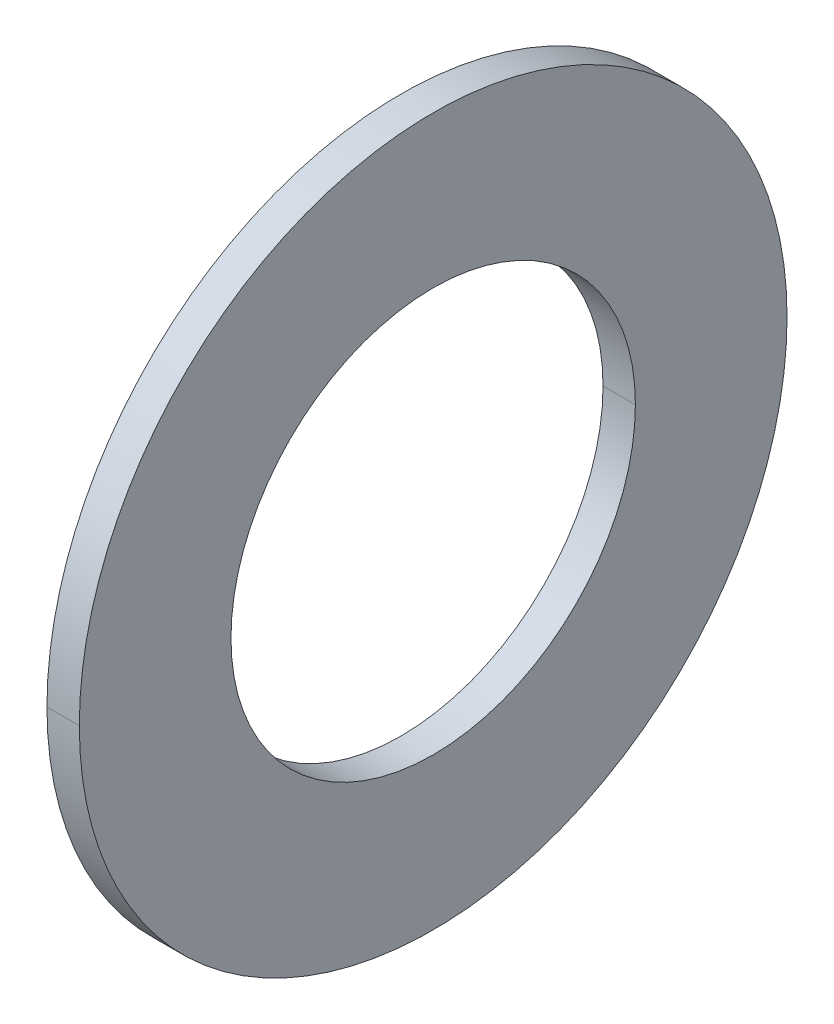
ISO-10303-21;
HEADER;
FILE_DESCRIPTION(('STEP AP214'),'2;1');
FILE_NAME('part.step','',(''),(''),'','','');
FILE_SCHEMA(('AUTOMOTIVE_DESIGN { 1 0 10303 214 1 1 1 1 }'));
ENDSEC;
DATA;
#1=APPLICATION_CONTEXT('core data for automotive mechanical design processes');
#2=APPLICATION_PROTOCOL_DEFINITION('international standard','automotive_design',2000,#1);
#3=PRODUCT_CONTEXT('',#1,'mechanical');
#4=PRODUCT('Part','Part','',(#3));
#5=PRODUCT_RELATED_PRODUCT_CATEGORY('part','',(#4));
#6=PRODUCT_DEFINITION_FORMATION('','',#4);
#7=PRODUCT_DEFINITION_CONTEXT('part definition',#1,'design');
#8=PRODUCT_DEFINITION('design','',#6,#7);
#9=PRODUCT_DEFINITION_SHAPE('','',#8);
#10=(LENGTH_UNIT() NAMED_UNIT(*) SI_UNIT(.MILLI.,.METRE.));
#11=(NAMED_UNIT(*) PLANE_ANGLE_UNIT() SI_UNIT($,.RADIAN.));
#12=(NAMED_UNIT(*) SI_UNIT($,.STERADIAN.) SOLID_ANGLE_UNIT());
#13=UNCERTAINTY_MEASURE_WITH_UNIT(LENGTH_MEASURE(1.E-05),#10,'distance_accuracy_value','');
#14=(GEOMETRIC_REPRESENTATION_CONTEXT(3) GLOBAL_UNCERTAINTY_ASSIGNED_CONTEXT((#13)) GLOBAL_UNIT_ASSIGNED_CONTEXT((#10,
#11,#12)) REPRESENTATION_CONTEXT('',''));
#15=CARTESIAN_POINT('',(0.,0.,0.));
#16=DIRECTION('',(0.,0.,1.));
#17=DIRECTION('',(1.,0.,0.));
#18=AXIS2_PLACEMENT_3D('',#15,#16,#17);
#19=CARTESIAN_POINT('',(0.8,0.,0.));
#20=DIRECTION('',(-1.,0.,0.));
#21=DIRECTION('',(0.,1.,0.));
#22=AXIS2_PLACEMENT_3D('',#19,#20,#21);
#23=CYLINDRICAL_SURFACE('',#22,10.);
#24=DIRECTION('',(-1.,0.,0.));
#25=VECTOR('',#24,1.);
#26=CARTESIAN_POINT('',(0.8,0.,-10.));
#27=LINE('',#26,#25);
#28=CARTESIAN_POINT('',(0.8,0.,-10.));
#29=VERTEX_POINT('',#28);
#30=CARTESIAN_POINT('',(-0.8,0.,-10.));
#31=VERTEX_POINT('',#30);
#32=EDGE_CURVE('E11',#29,#31,#27,.T.);
#33=ORIENTED_EDGE('',*,*,#32,.T.);
#34=CARTESIAN_POINT('',(-0.8,0.,0.));
#35=DIRECTION('',(1.,0.,0.));
#36=DIRECTION('',(0.,0.,-1.));
#37=AXIS2_PLACEMENT_3D('',#34,#35,#36);
#38=CIRCLE('',#37,10.);
#39=CARTESIAN_POINT('',(-0.8,0.,10.));
#40=VERTEX_POINT('',#39);
#41=EDGE_CURVE('E25',#40,#31,#38,.T.);
#42=ORIENTED_EDGE('',*,*,#41,.F.);
#43=DIRECTION('',(-1.,0.,0.));
#44=VECTOR('',#43,1.);
#45=CARTESIAN_POINT('',(0.8,0.,10.));
#46=LINE('',#45,#44);
#47=CARTESIAN_POINT('',(0.8,0.,10.));
#48=VERTEX_POINT('',#47);
#49=EDGE_CURVE('E94',#48,#40,#46,.T.);
#50=ORIENTED_EDGE('',*,*,#49,.F.);
#51=CARTESIAN_POINT('',(0.8,0.,0.));
#52=DIRECTION('',(1.,0.,0.));
#53=DIRECTION('',(0.,0.,-1.));
#54=AXIS2_PLACEMENT_3D('',#51,#52,#53);
#55=CIRCLE('',#54,10.);
#56=EDGE_CURVE('E90',#48,#29,#55,.T.);
#57=ORIENTED_EDGE('',*,*,#56,.T.);
#58=EDGE_LOOP('',(#33,#42,#50,#57));
#59=FACE_BOUND('',#58,.T.);
#60=ADVANCED_FACE('F17',(#59),#23,.F.);
#61=CARTESIAN_POINT('',(0.8,0.,0.));
#62=DIRECTION('',(1.,0.,0.));
#63=DIRECTION('',(0.,0.,-1.));
#64=AXIS2_PLACEMENT_3D('',#61,#62,#63);
#65=PLANE('',#64);
#66=ORIENTED_EDGE('',*,*,#56,.F.);
#67=CARTESIAN_POINT('',(0.8,0.,0.));
#68=DIRECTION('',(1.,0.,0.));
#69=DIRECTION('',(0.,0.,-1.));
#70=AXIS2_PLACEMENT_3D('',#67,#68,#69);
#71=CIRCLE('',#70,10.);
#72=EDGE_CURVE('E85',#29,#48,#71,.T.);
#73=ORIENTED_EDGE('',*,*,#72,.F.);
#74=EDGE_LOOP('',(#66,#73));
#75=FACE_BOUND('',#74,.T.);
#76=CARTESIAN_POINT('',(0.8,0.,0.));
#77=DIRECTION('',(1.,0.,0.));
#78=DIRECTION('',(0.,0.,-1.));
#79=AXIS2_PLACEMENT_3D('',#76,#77,#78);
#80=CIRCLE('',#79,17.5);
#81=CARTESIAN_POINT('',(0.8,0.,-17.5));
#82=VERTEX_POINT('',#81);
#83=CARTESIAN_POINT('',(0.8,0.,17.5));
#84=VERTEX_POINT('',#83);
#85=EDGE_CURVE('E72',#82,#84,#80,.T.);
#86=ORIENTED_EDGE('',*,*,#85,.T.);
#87=CARTESIAN_POINT('',(0.8,0.,0.));
#88=DIRECTION('',(1.,0.,0.));
#89=DIRECTION('',(0.,0.,-1.));
#90=AXIS2_PLACEMENT_3D('',#87,#88,#89);
#91=CIRCLE('',#90,17.5);
#92=EDGE_CURVE('E73',#84,#82,#91,.T.);
#93=ORIENTED_EDGE('',*,*,#92,.T.);
#94=EDGE_LOOP('',(#86,#93));
#95=FACE_BOUND('',#94,.T.);
#96=ADVANCED_FACE('F116',(#75,#95),#65,.T.);
#97=CARTESIAN_POINT('',(0.8,0.,0.));
#98=DIRECTION('',(-1.,0.,0.));
#99=DIRECTION('',(0.,1.,0.));
#100=AXIS2_PLACEMENT_3D('',#97,#98,#99);
#101=CYLINDRICAL_SURFACE('',#100,17.5);
#102=DIRECTION('',(-1.,0.,0.));
#103=VECTOR('',#102,1.);
#104=CARTESIAN_POINT('',(0.8,0.,-17.5));
#105=LINE('',#104,#103);
#106=CARTESIAN_POINT('',(-0.8,0.,-17.5));
#107=VERTEX_POINT('',#106);
#108=EDGE_CURVE('E59',#82,#107,#105,.T.);
#109=ORIENTED_EDGE('',*,*,#108,.F.);
#110=ORIENTED_EDGE('',*,*,#92,.F.);
#111=DIRECTION('',(-1.,0.,0.));
#112=VECTOR('',#111,1.);
#113=CARTESIAN_POINT('',(0.8,0.,17.5));
#114=LINE('',#113,#112);
#115=CARTESIAN_POINT('',(-0.8,0.,17.5));
#116=VERTEX_POINT('',#115);
#117=EDGE_CURVE('E61',#84,#116,#114,.T.);
#118=ORIENTED_EDGE('',*,*,#117,.T.);
#119=CARTESIAN_POINT('',(-0.8,0.,0.));
#120=DIRECTION('',(1.,0.,0.));
#121=DIRECTION('',(0.,0.,-1.));
#122=AXIS2_PLACEMENT_3D('',#119,#120,#121);
#123=CIRCLE('',#122,17.5);
#124=EDGE_CURVE('E54',#116,#107,#123,.T.);
#125=ORIENTED_EDGE('',*,*,#124,.T.);
#126=EDGE_LOOP('',(#109,#110,#118,#125));
#127=FACE_BOUND('',#126,.T.);
#128=ADVANCED_FACE('F56',(#127),#101,.T.);
#129=CARTESIAN_POINT('',(-0.8,0.,0.));
#130=DIRECTION('',(1.,0.,0.));
#131=DIRECTION('',(0.,0.,-1.));
#132=AXIS2_PLACEMENT_3D('',#129,#130,#131);
#133=PLANE('',#132);
#134=CARTESIAN_POINT('',(-0.8,0.,0.));
#135=DIRECTION('',(1.,0.,0.));
#136=DIRECTION('',(0.,0.,-1.));
#137=AXIS2_PLACEMENT_3D('',#134,#135,#136);
#138=CIRCLE('',#137,10.);
#139=EDGE_CURVE('E64',#31,#40,#138,.T.);
#140=ORIENTED_EDGE('',*,*,#139,.T.);
#141=ORIENTED_EDGE('',*,*,#41,.T.);
#142=EDGE_LOOP('',(#140,#141));
#143=FACE_BOUND('',#142,.T.);
#144=ORIENTED_EDGE('',*,*,#124,.F.);
#145=CARTESIAN_POINT('',(-0.8,0.,0.));
#146=DIRECTION('',(1.,0.,0.));
#147=DIRECTION('',(0.,0.,-1.));
#148=AXIS2_PLACEMENT_3D('',#145,#146,#147);
#149=CIRCLE('',#148,17.5);
#150=EDGE_CURVE('E66',#107,#116,#149,.T.);
#151=ORIENTED_EDGE('',*,*,#150,.F.);
#152=EDGE_LOOP('',(#144,#151));
#153=FACE_BOUND('',#152,.T.);
#154=ADVANCED_FACE('F67',(#143,#153),#133,.F.);
#155=CARTESIAN_POINT('',(0.8,0.,0.));
#156=DIRECTION('',(-1.,0.,0.));
#157=DIRECTION('',(0.,-1.,0.));
#158=AXIS2_PLACEMENT_3D('',#155,#156,#157);
#159=CYLINDRICAL_SURFACE('',#158,17.5);
#160=ORIENTED_EDGE('',*,*,#108,.T.);
#161=ORIENTED_EDGE('',*,*,#150,.T.);
#162=ORIENTED_EDGE('',*,*,#117,.F.);
#163=ORIENTED_EDGE('',*,*,#85,.F.);
#164=EDGE_LOOP('',(#160,#161,#162,#163));
#165=FACE_BOUND('',#164,.T.);
#166=ADVANCED_FACE('F71',(#165),#159,.T.);
#167=CARTESIAN_POINT('',(0.8,0.,0.));
#168=DIRECTION('',(-1.,0.,0.));
#169=DIRECTION('',(0.,-1.,0.));
#170=AXIS2_PLACEMENT_3D('',#167,#168,#169);
#171=CYLINDRICAL_SURFACE('',#170,10.);
#172=ORIENTED_EDGE('',*,*,#32,.F.);
#173=ORIENTED_EDGE('',*,*,#72,.T.);
#174=ORIENTED_EDGE('',*,*,#49,.T.);
#175=ORIENTED_EDGE('',*,*,#139,.F.);
#176=EDGE_LOOP('',(#172,#173,#174,#175));
#177=FACE_BOUND('',#176,.T.);
#178=ADVANCED_FACE('F112',(#177),#171,.F.);
#179=CLOSED_SHELL('',(#60,#96,#128,#154,#166,#178));
#180=MANIFOLD_SOLID_BREP('B1',#179);
#181=ADVANCED_BREP_SHAPE_REPRESENTATION('',(#18,#180),#14);
#182=SHAPE_DEFINITION_REPRESENTATION(#9,#181);
ENDSEC;
END-ISO-10303-21;
